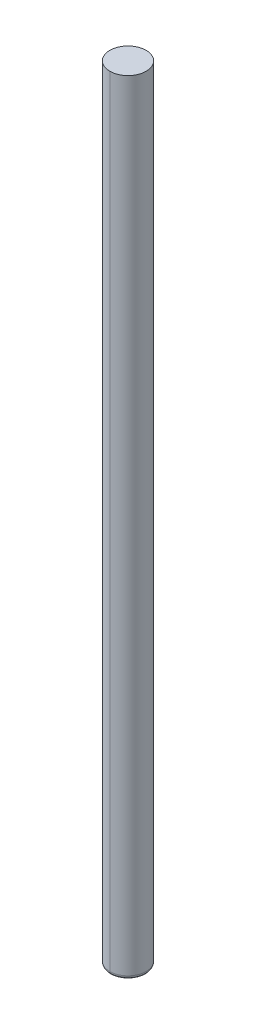
ISO-10303-21;
HEADER;
FILE_DESCRIPTION(('STEP AP214'),'2;1');
FILE_NAME('part.step','',(''),(''),'','','');
FILE_SCHEMA(('AUTOMOTIVE_DESIGN { 1 0 10303 214 1 1 1 1 }'));
ENDSEC;
DATA;
#1=APPLICATION_CONTEXT('core data for automotive mechanical design processes');
#2=APPLICATION_PROTOCOL_DEFINITION('international standard','automotive_design',2000,#1);
#3=PRODUCT_CONTEXT('',#1,'mechanical');
#4=PRODUCT('Part','Part','',(#3));
#5=PRODUCT_RELATED_PRODUCT_CATEGORY('part','',(#4));
#6=PRODUCT_DEFINITION_FORMATION('','',#4);
#7=PRODUCT_DEFINITION_CONTEXT('part definition',#1,'design');
#8=PRODUCT_DEFINITION('design','',#6,#7);
#9=PRODUCT_DEFINITION_SHAPE('','',#8);
#10=(LENGTH_UNIT() NAMED_UNIT(*) SI_UNIT(.MILLI.,.METRE.));
#11=(NAMED_UNIT(*) PLANE_ANGLE_UNIT() SI_UNIT($,.RADIAN.));
#12=(NAMED_UNIT(*) SI_UNIT($,.STERADIAN.) SOLID_ANGLE_UNIT());
#13=UNCERTAINTY_MEASURE_WITH_UNIT(LENGTH_MEASURE(1.E-05),#10,'distance_accuracy_value','');
#14=(GEOMETRIC_REPRESENTATION_CONTEXT(3) GLOBAL_UNCERTAINTY_ASSIGNED_CONTEXT((#13)) GLOBAL_UNIT_ASSIGNED_CONTEXT((#10,
#11,#12)) REPRESENTATION_CONTEXT('',''));
#15=CARTESIAN_POINT('',(0.,0.,0.));
#16=DIRECTION('',(0.,0.,1.));
#17=DIRECTION('',(1.,0.,0.));
#18=AXIS2_PLACEMENT_3D('',#15,#16,#17);
#19=CARTESIAN_POINT('',(-0.51,18.6,-0.51));
#20=DIRECTION('',(0.,1.,0.));
#21=DIRECTION('',(1.,0.,0.));
#22=AXIS2_PLACEMENT_3D('',#19,#20,#21);
#23=PLANE('',#22);
#24=CARTESIAN_POINT('',(0.,18.6,0.));
#25=DIRECTION('',(0.,-1.,0.));
#26=DIRECTION('',(0.,0.,-1.));
#27=AXIS2_PLACEMENT_3D('',#24,#25,#26);
#28=CIRCLE('',#27,0.5);
#29=CARTESIAN_POINT('',(0.,18.6,-0.5));
#30=VERTEX_POINT('',#29);
#31=CARTESIAN_POINT('',(0.,18.6,0.5));
#32=VERTEX_POINT('',#31);
#33=EDGE_CURVE('E96',#30,#32,#28,.T.);
#34=ORIENTED_EDGE('',*,*,#33,.F.);
#35=CARTESIAN_POINT('',(0.,18.6,0.));
#36=DIRECTION('',(0.,-1.,0.));
#37=DIRECTION('',(0.,0.,-1.));
#38=AXIS2_PLACEMENT_3D('',#35,#36,#37);
#39=CIRCLE('',#38,0.5);
#40=EDGE_CURVE('E11',#32,#30,#39,.T.);
#41=ORIENTED_EDGE('',*,*,#40,.F.);
#42=EDGE_LOOP('',(#34,#41));
#43=FACE_BOUND('',#42,.T.);
#44=ADVANCED_FACE('F16',(#43),#23,.T.);
#45=CARTESIAN_POINT('',(-0.41,-3.,0.41));
#46=DIRECTION('',(0.,-1.,0.));
#47=DIRECTION('',(0.,0.,-1.));
#48=AXIS2_PLACEMENT_3D('',#45,#46,#47);
#49=PLANE('',#48);
#50=CARTESIAN_POINT('',(0.,-3.,0.));
#51=DIRECTION('',(0.,1.,0.));
#52=DIRECTION('',(0.,0.,1.));
#53=AXIS2_PLACEMENT_3D('',#50,#51,#52);
#54=CIRCLE('',#53,0.400000000001876);
#55=CARTESIAN_POINT('',(0.,-3.,0.400000000001876));
#56=VERTEX_POINT('',#55);
#57=CARTESIAN_POINT('',(0.,-3.,-0.400000000001876));
#58=VERTEX_POINT('',#57);
#59=EDGE_CURVE('E72',#56,#58,#54,.T.);
#60=ORIENTED_EDGE('',*,*,#59,.F.);
#61=CARTESIAN_POINT('',(0.,-3.,0.));
#62=DIRECTION('',(0.,1.,0.));
#63=DIRECTION('',(0.,0.,1.));
#64=AXIS2_PLACEMENT_3D('',#61,#62,#63);
#65=CIRCLE('',#64,0.400000000001876);
#66=EDGE_CURVE('E70',#58,#56,#65,.T.);
#67=ORIENTED_EDGE('',*,*,#66,.F.);
#68=EDGE_LOOP('',(#60,#67));
#69=FACE_BOUND('',#68,.T.);
#70=ADVANCED_FACE('F18',(#69),#49,.T.);
#71=CARTESIAN_POINT('',(0.,18.6,0.));
#72=DIRECTION('',(0.,-1.,0.));
#73=DIRECTION('',(0.,0.,-1.));
#74=AXIS2_PLACEMENT_3D('',#71,#72,#73);
#75=CYLINDRICAL_SURFACE('',#74,0.5);
#76=DIRECTION('',(0.,-1.,0.));
#77=VECTOR('',#76,1.);
#78=CARTESIAN_POINT('',(0.,18.6,0.5));
#79=LINE('',#78,#77);
#80=CARTESIAN_POINT('',(0.,-2.9,0.5));
#81=VERTEX_POINT('',#80);
#82=EDGE_CURVE('E93',#32,#81,#79,.T.);
#83=ORIENTED_EDGE('',*,*,#82,.F.);
#84=ORIENTED_EDGE('',*,*,#40,.T.);
#85=DIRECTION('',(0.,-1.,0.));
#86=VECTOR('',#85,1.);
#87=CARTESIAN_POINT('',(0.,18.6,-0.5));
#88=LINE('',#87,#86);
#89=CARTESIAN_POINT('',(0.,-2.9,-0.5));
#90=VERTEX_POINT('',#89);
#91=EDGE_CURVE('E75',#30,#90,#88,.T.);
#92=ORIENTED_EDGE('',*,*,#91,.T.);
#93=CARTESIAN_POINT('',(0.,-2.9,0.));
#94=DIRECTION('',(0.,-1.,0.));
#95=DIRECTION('',(0.,0.,-1.));
#96=AXIS2_PLACEMENT_3D('',#93,#94,#95);
#97=CIRCLE('',#96,0.5);
#98=EDGE_CURVE('E27',#81,#90,#97,.T.);
#99=ORIENTED_EDGE('',*,*,#98,.F.);
#100=EDGE_LOOP('',(#83,#84,#92,#99));
#101=FACE_BOUND('',#100,.T.);
#102=ADVANCED_FACE('F145',(#101),#75,.T.);
#103=CARTESIAN_POINT('',(0.,-2.9,0.));
#104=DIRECTION('',(0.,1.,0.));
#105=DIRECTION('',(0.,0.,1.));
#106=AXIS2_PLACEMENT_3D('',#103,#104,#105);
#107=TOROIDAL_SURFACE('',#106,0.4,0.1);
#108=CARTESIAN_POINT('',(0.,-2.9,-0.4));
#109=DIRECTION('',(1.,0.,0.));
#110=DIRECTION('',(0.,0.,-1.));
#111=AXIS2_PLACEMENT_3D('',#108,#109,#110);
#112=CIRCLE('',#111,0.1);
#113=EDGE_CURVE('E78',#58,#90,#112,.T.);
#114=ORIENTED_EDGE('',*,*,#113,.F.);
#115=ORIENTED_EDGE('',*,*,#66,.T.);
#116=CARTESIAN_POINT('',(0.,-2.9,0.4));
#117=DIRECTION('',(-1.,0.,0.));
#118=DIRECTION('',(0.,0.,1.));
#119=AXIS2_PLACEMENT_3D('',#116,#117,#118);
#120=CIRCLE('',#119,0.1);
#121=EDGE_CURVE('E84',#56,#81,#120,.T.);
#122=ORIENTED_EDGE('',*,*,#121,.T.);
#123=ORIENTED_EDGE('',*,*,#98,.T.);
#124=EDGE_LOOP('',(#114,#115,#122,#123));
#125=FACE_BOUND('',#124,.T.);
#126=ADVANCED_FACE('F79',(#125),#107,.T.);
#127=CARTESIAN_POINT('',(0.,18.6,0.));
#128=DIRECTION('',(0.,-1.,0.));
#129=DIRECTION('',(0.,0.,-1.));
#130=AXIS2_PLACEMENT_3D('',#127,#128,#129);
#131=CYLINDRICAL_SURFACE('',#130,0.5);
#132=ORIENTED_EDGE('',*,*,#33,.T.);
#133=ORIENTED_EDGE('',*,*,#82,.T.);
#134=CARTESIAN_POINT('',(0.,-2.9,0.));
#135=DIRECTION('',(0.,-1.,0.));
#136=DIRECTION('',(0.,0.,-1.));
#137=AXIS2_PLACEMENT_3D('',#134,#135,#136);
#138=CIRCLE('',#137,0.5);
#139=EDGE_CURVE('E20',#90,#81,#138,.T.);
#140=ORIENTED_EDGE('',*,*,#139,.F.);
#141=ORIENTED_EDGE('',*,*,#91,.F.);
#142=EDGE_LOOP('',(#132,#133,#140,#141));
#143=FACE_BOUND('',#142,.T.);
#144=ADVANCED_FACE('F144',(#143),#131,.T.);
#145=CARTESIAN_POINT('',(0.,-2.9,0.));
#146=DIRECTION('',(0.,1.,0.));
#147=DIRECTION('',(0.,0.,1.));
#148=AXIS2_PLACEMENT_3D('',#145,#146,#147);
#149=TOROIDAL_SURFACE('',#148,0.4,0.1);
#150=ORIENTED_EDGE('',*,*,#59,.T.);
#151=ORIENTED_EDGE('',*,*,#113,.T.);
#152=ORIENTED_EDGE('',*,*,#139,.T.);
#153=ORIENTED_EDGE('',*,*,#121,.F.);
#154=EDGE_LOOP('',(#150,#151,#152,#153));
#155=FACE_BOUND('',#154,.T.);
#156=ADVANCED_FACE('F83',(#155),#149,.T.);
#157=CLOSED_SHELL('',(#44,#70,#102,#126,#144,#156));
#158=MANIFOLD_SOLID_BREP('B1',#157);
#159=ADVANCED_BREP_SHAPE_REPRESENTATION('',(#18,#158),#14);
#160=SHAPE_DEFINITION_REPRESENTATION(#9,#159);
ENDSEC;
END-ISO-10303-21;
